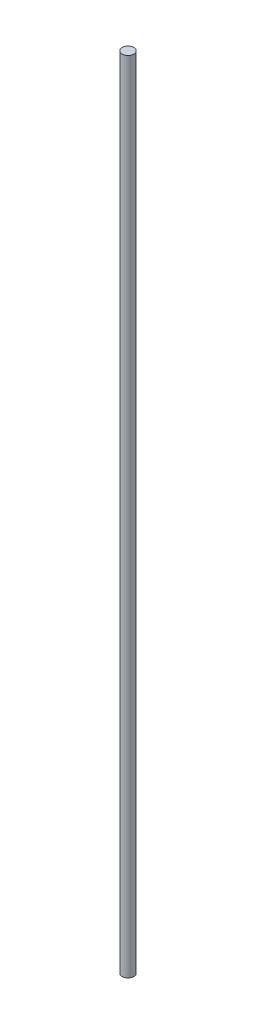
ISO-10303-21;
HEADER;
FILE_DESCRIPTION(('STEP AP214'),'2;1');
FILE_NAME('part.step','',(''),(''),'','','');
FILE_SCHEMA(('AUTOMOTIVE_DESIGN { 1 0 10303 214 1 1 1 1 }'));
ENDSEC;
DATA;
#1=APPLICATION_CONTEXT('core data for automotive mechanical design processes');
#2=APPLICATION_PROTOCOL_DEFINITION('international standard','automotive_design',2000,#1);
#3=PRODUCT_CONTEXT('',#1,'mechanical');
#4=PRODUCT('Part','Part','',(#3));
#5=PRODUCT_RELATED_PRODUCT_CATEGORY('part','',(#4));
#6=PRODUCT_DEFINITION_FORMATION('','',#4);
#7=PRODUCT_DEFINITION_CONTEXT('part definition',#1,'design');
#8=PRODUCT_DEFINITION('design','',#6,#7);
#9=PRODUCT_DEFINITION_SHAPE('','',#8);
#10=(LENGTH_UNIT() NAMED_UNIT(*) SI_UNIT(.MILLI.,.METRE.));
#11=(NAMED_UNIT(*) PLANE_ANGLE_UNIT() SI_UNIT($,.RADIAN.));
#12=(NAMED_UNIT(*) SI_UNIT($,.STERADIAN.) SOLID_ANGLE_UNIT());
#13=UNCERTAINTY_MEASURE_WITH_UNIT(LENGTH_MEASURE(1.E-05),#10,'distance_accuracy_value','');
#14=(GEOMETRIC_REPRESENTATION_CONTEXT(3) GLOBAL_UNCERTAINTY_ASSIGNED_CONTEXT((#13)) GLOBAL_UNIT_ASSIGNED_CONTEXT((#10,
#11,#12)) REPRESENTATION_CONTEXT('',''));
#15=CARTESIAN_POINT('',(0.,0.,0.));
#16=DIRECTION('',(0.,0.,1.));
#17=DIRECTION('',(1.,0.,0.));
#18=AXIS2_PLACEMENT_3D('',#15,#16,#17);
#19=CARTESIAN_POINT('',(0.,550.,0.));
#20=DIRECTION('',(0.,-1.,0.));
#21=DIRECTION('',(0.,0.,-1.));
#22=AXIS2_PLACEMENT_3D('',#19,#20,#21);
#23=CYLINDRICAL_SURFACE('',#22,4.);
#24=CARTESIAN_POINT('',(0.,550.,0.));
#25=DIRECTION('',(0.,1.,0.));
#26=DIRECTION('',(0.,0.,1.));
#27=AXIS2_PLACEMENT_3D('',#24,#25,#26);
#28=CIRCLE('',#27,4.);
#29=CARTESIAN_POINT('',(0.,550.,4.));
#30=VERTEX_POINT('',#29);
#31=EDGE_CURVE('E10',#30,#30,#28,.T.);
#32=ORIENTED_EDGE('',*,*,#31,.F.);
#33=EDGE_LOOP('',(#32));
#34=FACE_BOUND('',#33,.T.);
#35=CARTESIAN_POINT('',(0.,0.,0.));
#36=DIRECTION('',(0.,1.,0.));
#37=DIRECTION('',(0.,0.,1.));
#38=AXIS2_PLACEMENT_3D('',#35,#36,#37);
#39=CIRCLE('',#38,4.);
#40=CARTESIAN_POINT('',(0.,0.,4.));
#41=VERTEX_POINT('',#40);
#42=EDGE_CURVE('E33',#41,#41,#39,.T.);
#43=ORIENTED_EDGE('',*,*,#42,.T.);
#44=EDGE_LOOP('',(#43));
#45=FACE_BOUND('',#44,.T.);
#46=ADVANCED_FACE('F30',(#34,#45),#23,.T.);
#47=CARTESIAN_POINT('',(0.,550.,0.));
#48=DIRECTION('',(0.,1.,0.));
#49=DIRECTION('',(0.,0.,1.));
#50=AXIS2_PLACEMENT_3D('',#47,#48,#49);
#51=PLANE('',#50);
#52=ORIENTED_EDGE('',*,*,#31,.T.);
#53=EDGE_LOOP('',(#52));
#54=FACE_BOUND('',#53,.T.);
#55=ADVANCED_FACE('F45',(#54),#51,.T.);
#56=CARTESIAN_POINT('',(0.,0.,0.));
#57=DIRECTION('',(0.,1.,0.));
#58=DIRECTION('',(0.,0.,1.));
#59=AXIS2_PLACEMENT_3D('',#56,#57,#58);
#60=PLANE('',#59);
#61=ORIENTED_EDGE('',*,*,#42,.F.);
#62=EDGE_LOOP('',(#61));
#63=FACE_BOUND('',#62,.T.);
#64=ADVANCED_FACE('F43',(#63),#60,.F.);
#65=CLOSED_SHELL('',(#46,#55,#64));
#66=MANIFOLD_SOLID_BREP('B2',#65);
#67=ADVANCED_BREP_SHAPE_REPRESENTATION('',(#18,#66),#14);
#68=SHAPE_DEFINITION_REPRESENTATION(#9,#67);
ENDSEC;
END-ISO-10303-21;
